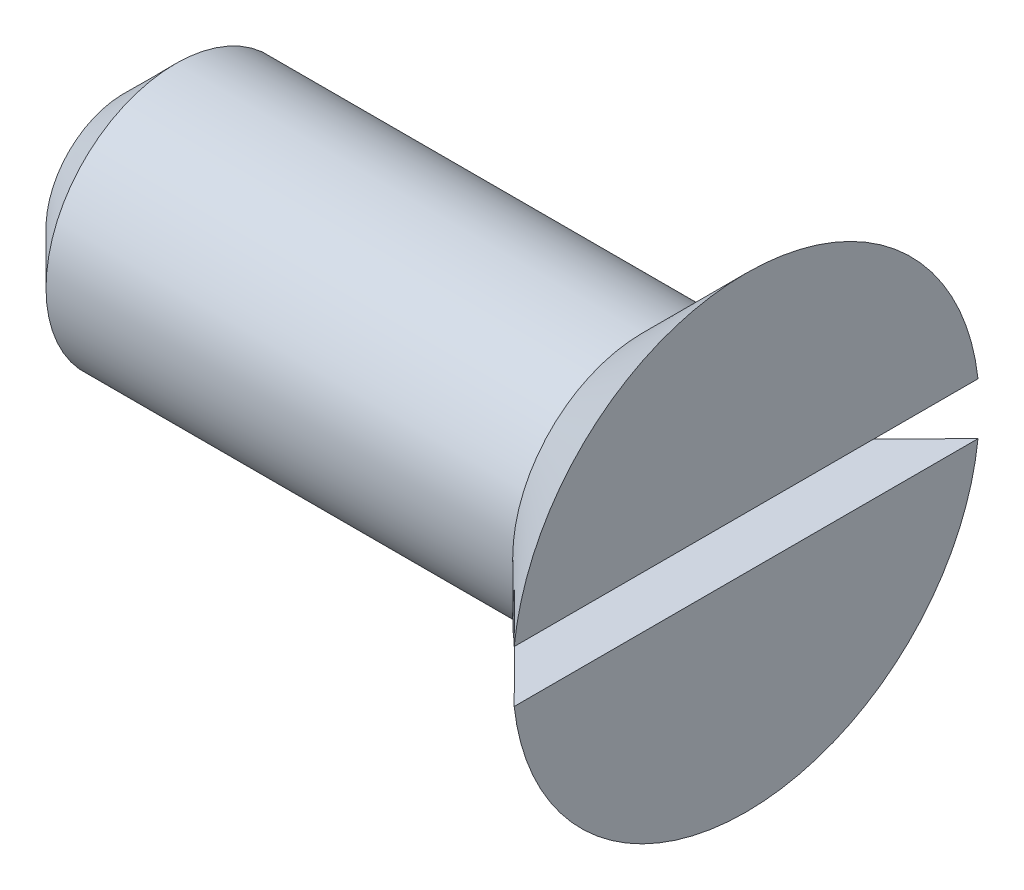
ISO-10303-21;
HEADER;
FILE_DESCRIPTION(('STEP AP214'),'2;1');
FILE_NAME('part.step','',(''),(''),'','','');
FILE_SCHEMA(('AUTOMOTIVE_DESIGN { 1 0 10303 214 1 1 1 1 }'));
ENDSEC;
DATA;
#1=APPLICATION_CONTEXT('core data for automotive mechanical design processes');
#2=APPLICATION_PROTOCOL_DEFINITION('international standard','automotive_design',2000,#1);
#3=PRODUCT_CONTEXT('',#1,'mechanical');
#4=PRODUCT('Part','Part','',(#3));
#5=PRODUCT_RELATED_PRODUCT_CATEGORY('part','',(#4));
#6=PRODUCT_DEFINITION_FORMATION('','',#4);
#7=PRODUCT_DEFINITION_CONTEXT('part definition',#1,'design');
#8=PRODUCT_DEFINITION('design','',#6,#7);
#9=PRODUCT_DEFINITION_SHAPE('','',#8);
#10=(LENGTH_UNIT() NAMED_UNIT(*) SI_UNIT(.MILLI.,.METRE.));
#11=(NAMED_UNIT(*) PLANE_ANGLE_UNIT() SI_UNIT($,.RADIAN.));
#12=(NAMED_UNIT(*) SI_UNIT($,.STERADIAN.) SOLID_ANGLE_UNIT());
#13=UNCERTAINTY_MEASURE_WITH_UNIT(LENGTH_MEASURE(1.E-05),#10,'distance_accuracy_value','');
#14=(GEOMETRIC_REPRESENTATION_CONTEXT(3) GLOBAL_UNCERTAINTY_ASSIGNED_CONTEXT((#13)) GLOBAL_UNIT_ASSIGNED_CONTEXT((#10,
#11,#12)) REPRESENTATION_CONTEXT('',''));
#15=CARTESIAN_POINT('',(0.,0.,0.));
#16=DIRECTION('',(0.,0.,1.));
#17=DIRECTION('',(1.,0.,0.));
#18=AXIS2_PLACEMENT_3D('',#15,#16,#17);
#19=CARTESIAN_POINT('',(12.,0.,-4.50000000000001));
#20=DIRECTION('',(-1.,0.,0.));
#21=DIRECTION('',(0.,0.,1.));
#22=AXIS2_PLACEMENT_3D('',#19,#20,#21);
#23=PLANE('',#22);
#24=CARTESIAN_POINT('',(12.,0.,0.));
#25=DIRECTION('',(-1.,0.,0.));
#26=DIRECTION('',(0.,0.,1.));
#27=AXIS2_PLACEMENT_3D('',#24,#25,#26);
#28=CIRCLE('',#27,4.50000000000001);
#29=CARTESIAN_POINT('',(12.,0.499999999999999,4.47213595499959));
#30=VERTEX_POINT('',#29);
#31=CARTESIAN_POINT('',(12.,0.500000000000001,-4.47213595499959));
#32=VERTEX_POINT('',#31);
#33=EDGE_CURVE('E96',#30,#32,#28,.T.);
#34=ORIENTED_EDGE('',*,*,#33,.F.);
#35=DIRECTION('',(0.,0.,1.));
#36=VECTOR('',#35,1.);
#37=CARTESIAN_POINT('',(12.,0.500000000000001,-4.82876236688435));
#38=LINE('',#37,#36);
#39=EDGE_CURVE('E91',#32,#30,#38,.T.);
#40=ORIENTED_EDGE('',*,*,#39,.F.);
#41=EDGE_LOOP('',(#34,#40));
#42=FACE_BOUND('',#41,.T.);
#43=ADVANCED_FACE('F35',(#42),#23,.F.);
#44=CARTESIAN_POINT('',(0.,0.,-2.5));
#45=DIRECTION('',(1.,0.,0.));
#46=DIRECTION('',(0.,0.,-1.));
#47=AXIS2_PLACEMENT_3D('',#44,#45,#46);
#48=PLANE('',#47);
#49=CARTESIAN_POINT('',(0.,0.,0.));
#50=DIRECTION('',(1.,0.,0.));
#51=DIRECTION('',(0.,0.,-1.));
#52=AXIS2_PLACEMENT_3D('',#49,#50,#51);
#53=CIRCLE('',#52,1.5);
#54=CARTESIAN_POINT('',(0.,0.,-1.5));
#55=VERTEX_POINT('',#54);
#56=EDGE_CURVE('E100',#55,#55,#53,.F.);
#57=ORIENTED_EDGE('',*,*,#56,.T.);
#58=EDGE_LOOP('',(#57));
#59=FACE_BOUND('',#58,.T.);
#60=ADVANCED_FACE('F135',(#59),#48,.F.);
#61=CARTESIAN_POINT('',(12.,-0.499999999999999,-4.47213595499959));
#62=VERTEX_POINT('',#61);
#63=CARTESIAN_POINT('',(12.,-0.500000000000001,4.47213595499959));
#64=VERTEX_POINT('',#63);
#65=EDGE_CURVE('E90',#62,#64,#28,.T.);
#66=ORIENTED_EDGE('',*,*,#65,.F.);
#67=DIRECTION('',(0.,0.,-1.));
#68=VECTOR('',#67,1.);
#69=CARTESIAN_POINT('',(12.,-0.499999999999999,-4.82876236688435));
#70=LINE('',#69,#68);
#71=EDGE_CURVE('E82',#64,#62,#70,.T.);
#72=ORIENTED_EDGE('',*,*,#71,.F.);
#73=EDGE_LOOP('',(#66,#72));
#74=FACE_BOUND('',#73,.T.);
#75=ADVANCED_FACE('F89',(#74),#23,.F.);
#76=CARTESIAN_POINT('',(12.,0.,0.));
#77=DIRECTION('',(1.,0.,0.));
#78=DIRECTION('',(0.,0.,-1.));
#79=AXIS2_PLACEMENT_3D('',#76,#77,#78);
#80=CONICAL_SURFACE('',#79,4.50000000000001,0.78539816339745);
#81=CARTESIAN_POINT('',(11.,0.,0.));
#82=DIRECTION('',(1.,0.,0.));
#83=DIRECTION('',(0.,0.,-1.));
#84=AXIS2_PLACEMENT_3D('',#81,#82,#83);
#85=CIRCLE('',#84,3.5);
#86=CARTESIAN_POINT('',(11.,0.5,3.46410161513776));
#87=VERTEX_POINT('',#86);
#88=CARTESIAN_POINT('',(11.,-0.5,3.46410161513776));
#89=VERTEX_POINT('',#88);
#90=EDGE_CURVE('E61',#87,#89,#85,.T.);
#91=ORIENTED_EDGE('',*,*,#90,.F.);
#92=CARTESIAN_POINT('',(17.4334310828825,0.500000000000001,-9.92083933336167));
#93=CARTESIAN_POINT('',(17.0946228366973,0.500000000000001,-9.58159761232873));
#94=CARTESIAN_POINT('',(16.7558333911426,0.500000000000001,-9.2423371047864));
#95=CARTESIAN_POINT('',(16.0783139348755,0.500000000000001,-8.56375204602205));
#96=CARTESIAN_POINT('',(15.739583924592,0.500000000000001,-8.22442749437174));
#97=CARTESIAN_POINT('',(15.0621562101748,0.500000000000001,-7.54563881131531));
#98=CARTESIAN_POINT('',(14.7234585196653,0.500000000000001,-7.20617466631178));
#99=CARTESIAN_POINT('',(14.0461951542344,0.500000000000001,-6.52711926847519));
#100=CARTESIAN_POINT('',(13.7076294784351,0.500000000000001,-6.18752801651797));
#101=CARTESIAN_POINT('',(13.0230688559564,0.500000000000001,-5.50046940667581));
#102=CARTESIAN_POINT('',(12.6770786993011,0.500000000000001,-5.15299727609709));
#103=CARTESIAN_POINT('',(11.9854716695163,0.500000000000001,-4.45766761429764));
#104=CARTESIAN_POINT('',(11.6398548039755,0.500000000000001,-4.10981007552263));
#105=CARTESIAN_POINT('',(11.1220495656038,0.5,-3.58744392362607));
#106=CARTESIAN_POINT('',(10.9495599143595,0.5,-3.41323410184891));
#107=CARTESIAN_POINT('',(10.6049016321717,0.5,-3.06449437077969));
#108=CARTESIAN_POINT('',(10.4327330038442,0.5,-2.88996445890203));
#109=CARTESIAN_POINT('',(10.0889298219536,0.5,-2.54039099536454));
#110=CARTESIAN_POINT('',(9.91729524885471,0.5,-2.36534746295891));
#111=CARTESIAN_POINT('',(9.66060434587554,0.5,-2.10204221393845));
#112=CARTESIAN_POINT('',(9.57516809923433,0.5,-2.0141510552663));
#113=CARTESIAN_POINT('',(9.40467044483115,0.5,-1.83800611141631));
#114=CARTESIAN_POINT('',(9.31960903527122,0.5,-1.74975232798178));
#115=CARTESIAN_POINT('',(9.18895844071343,0.5,-1.61330986537998));
#116=CARTESIAN_POINT('',(9.14316496752917,0.5,-1.56531689311638));
#117=CARTESIAN_POINT('',(9.05179993977996,0.5,-1.46911892921277));
#118=CARTESIAN_POINT('',(9.00622838798683,0.5,-1.42091393493881));
#119=CARTESIAN_POINT('',(8.91548272609732,0.5,-1.32433574945206));
#120=CARTESIAN_POINT('',(8.87030795026291,0.5,-1.2759631851432));
#121=CARTESIAN_POINT('',(8.7803664438275,0.5,-1.17884327238506));
#122=CARTESIAN_POINT('',(8.73559970075942,0.5,-1.13009593547108));
#123=CARTESIAN_POINT('',(8.63156798542612,0.5,-1.01549018412831));
#124=CARTESIAN_POINT('',(8.57252649589827,0.5,-0.949426917329317));
#125=CARTESIAN_POINT('',(8.48517998290922,0.5,-0.849027252818854));
#126=CARTESIAN_POINT('',(8.45620834486431,0.5,-0.815271939590713));
#127=CARTESIAN_POINT('',(8.39889657787292,0.5,-0.747230628197203));
#128=CARTESIAN_POINT('',(8.37055641002426,0.5,-0.712944662944775));
#129=CARTESIAN_POINT('',(8.3145329446323,0.5,-0.643346670958045));
#130=CARTESIAN_POINT('',(8.28685743704767,0.5,-0.608028338857883));
#131=CARTESIAN_POINT('',(8.23288658906743,0.5,-0.536358792809923));
#132=CARTESIAN_POINT('',(8.20659077183423,0.5,-0.500007942497519));
#133=CARTESIAN_POINT('',(8.15629156070253,0.5,-0.425977065401623));
#134=CARTESIAN_POINT('',(8.13227821986791,0.5,-0.388303888131556));
#135=CARTESIAN_POINT('',(8.08791744878541,0.5,-0.310893832366642));
#136=CARTESIAN_POINT('',(8.06756045180677,0.5,-0.271162700482673));
#137=CARTESIAN_POINT('',(8.03752958522045,0.5,-0.199280580631231));
#138=CARTESIAN_POINT('',(8.02645653543281,0.5,-0.167736256205768));
#139=CARTESIAN_POINT('',(8.0096325080779,0.5,-0.103336815944202));
#140=CARTESIAN_POINT('',(8.00385536010018,0.5,-0.0704889918034758));
#141=CARTESIAN_POINT('',(7.99890901284611,0.5,-0.00391759075675042));
#142=CARTESIAN_POINT('',(7.99980881923364,0.5,0.0298115312901689));
#143=CARTESIAN_POINT('',(8.00813776796033,0.5,0.0965071541620183));
#144=CARTESIAN_POINT('',(8.01558887477223,0.5,0.129470706321317));
#145=CARTESIAN_POINT('',(8.03280310431991,0.5,0.185466604172844));
#146=CARTESIAN_POINT('',(8.04146820312044,0.5,0.208860616960488));
#147=CARTESIAN_POINT('',(8.06080064801209,0.5,0.25481666318091));
#148=CARTESIAN_POINT('',(8.07146948011857,0.5,0.277378064174972));
#149=CARTESIAN_POINT('',(8.09431898535455,0.5,0.321840394643773));
#150=CARTESIAN_POINT('',(8.10650643866038,0.5,0.343737776914007));
#151=CARTESIAN_POINT('',(8.13196003283893,0.5,0.386877858467677));
#152=CARTESIAN_POINT('',(8.14522573137349,0.5,0.408120821336482));
#153=CARTESIAN_POINT('',(8.19135616707461,0.5,0.478982606501848));
#154=CARTESIAN_POINT('',(8.22605662646362,0.5,0.527397940682404));
#155=CARTESIAN_POINT('',(8.29781340694133,0.5,0.622462852285317));
#156=CARTESIAN_POINT('',(8.33487192774727,0.5,0.669110714249816));
#157=CARTESIAN_POINT('',(8.41048560367645,0.5,0.761369243961061));
#158=CARTESIAN_POINT('',(8.44904426520717,0.5,0.806977030623934));
#159=CARTESIAN_POINT('',(8.52703681580963,0.5,0.897398644490791));
#160=CARTESIAN_POINT('',(8.56647033422441,0.5,0.942212793997126));
#161=CARTESIAN_POINT('',(8.64602665873742,0.5,1.03139885551567));
#162=CARTESIAN_POINT('',(8.68615077588472,0.5,1.0757695956385));
#163=CARTESIAN_POINT('',(8.76683137244624,0.5,1.16412357585895));
#164=CARTESIAN_POINT('',(8.80738789578226,0.5,1.20810677574714));
#165=CARTESIAN_POINT('',(8.92939021280778,0.5,1.33948593317254));
#166=CARTESIAN_POINT('',(9.01129691946354,0.5,1.4264534203661));
#167=CARTESIAN_POINT('',(9.1750561674327,0.5,1.5989137134355));
#168=CARTESIAN_POINT('',(9.256902208501,0.5,1.68441271958706));
#169=CARTESIAN_POINT('',(9.42104405611673,0.5,1.85497829095495));
#170=CARTESIAN_POINT('',(9.50333986440311,0.5,1.94004485449686));
#171=CARTESIAN_POINT('',(9.75067700605355,0.5,2.19481879501892));
#172=CARTESIAN_POINT('',(9.91616244229036,0.5,2.36409455788242));
#173=CARTESIAN_POINT('',(10.2478424695678,0.5,2.70216112923891));
#174=CARTESIAN_POINT('',(10.4140374466652,0.5,2.87095155805323));
#175=CARTESIAN_POINT('',(10.746786507318,0.5,3.20817270389182));
#176=CARTESIAN_POINT('',(10.9133405850955,0.5,3.37660342661822));
#177=CARTESIAN_POINT('',(11.2461450940213,0.5,3.71270085679017));
#178=CARTESIAN_POINT('',(11.4123947962971,0.5,3.88036828639741));
#179=CARTESIAN_POINT('',(11.7450495611608,0.5,4.21555034245577));
#180=CARTESIAN_POINT('',(11.9114546244026,0.499999999999999,4.38306496825788));
#181=CARTESIAN_POINT('',(12.4107648936874,0.499999999999999,4.88538300082721));
#182=CARTESIAN_POINT('',(12.7438307481319,0.499999999999999,5.2200266956286));
#183=CARTESIAN_POINT('',(13.4391444176961,0.499999999999999,5.91814806333948));
#184=CARTESIAN_POINT('',(13.8014133442453,0.499999999999999,6.28160470105013));
#185=CARTESIAN_POINT('',(14.5261395420025,0.499999999999999,7.0083789684796));
#186=CARTESIAN_POINT('',(14.8885968242542,0.499999999999999,7.37169658718518));
#187=CARTESIAN_POINT('',(15.6147555520495,0.499999999999999,8.09937108507478));
#188=CARTESIAN_POINT('',(15.9784573244745,0.499999999999999,8.46372763802071));
#189=CARTESIAN_POINT('',(16.7059094181817,0.499999999999999,9.19234290705773));
#190=CARTESIAN_POINT('',(17.0696597344943,0.499999999999999,9.55660162811023));
#191=CARTESIAN_POINT('',(17.4334310828825,0.499999999999999,9.92083933336167));
#192=B_SPLINE_CURVE_WITH_KNOTS('',3,(#92,#93,#94,#95,#96,#97,#98,#99,#100,#101,#102,#103,#104,
#105,#106,#107,#108,#109,#110,#111,#112,#113,#114,#115,#116,#117,#118,#119,#120,#121,#122,#123,
#124,#125,#126,#127,#128,#129,#130,#131,#132,#133,#134,#135,#136,#137,#138,#139,#140,#141,#142,
#143,#144,#145,#146,#147,#148,#149,#150,#151,#152,#153,#154,#155,#156,#157,#158,#159,#160,#161,
#162,#163,#164,#165,#166,#167,#168,#169,#170,#171,#172,#173,#174,#175,#176,#177,#178,#179,#180,
#181,#182,#183,#184,#185,#186,#187,#188,#189,#190,#191),.UNSPECIFIED.,.F.,.F.,(4,2,2,2,2,2,2,2,
2,2,2,2,2,2,2,2,2,2,2,2,2,2,2,2,2,2,2,2,2,2,2,2,2,2,2,2,2,2,2,2,2,2,2,2,2,2,2,2,2,4),(0.,
1.43836149369586,2.87673297314477,4.31533237234486,5.75392203488505,7.22498096900736,
8.69606926591944,9.43153865323627,10.1670140078309,10.9024621350021,11.2701813429493,
11.6378987851441,11.8369040385591,12.0359117712346,12.234469454211,12.4330210499611,
12.6988031931159,12.8322483695487,12.9656853021402,13.1002750154335,13.2348179022846,
13.368744633288,13.5023156749386,13.6022937476694,13.7017750593223,13.8022859216984,
13.9031350562218,13.9778743300512,14.0526692527234,14.1278109554225,14.2029219861666,
14.3814550436047,14.560157159055,14.7393055443467,14.9183794257298,15.0978422373141,
15.2773234549253,15.6357121558071,15.9907874462889,16.3458641105813,17.0560417926077,
17.76667396055,18.4772947785456,19.1856462514834,19.8940007191567,21.3104302706823,
22.849928673822,24.3895307818801,25.9339763327718,27.4783170755757),.UNSPECIFIED.);
#193=EDGE_CURVE('E11',#87,#30,#192,.T.);
#194=ORIENTED_EDGE('',*,*,#193,.T.);
#195=ORIENTED_EDGE('',*,*,#33,.T.);
#196=CARTESIAN_POINT('',(11.,0.5,-3.46410161513776));
#197=VERTEX_POINT('',#196);
#198=EDGE_CURVE('E39',#32,#197,#192,.T.);
#199=ORIENTED_EDGE('',*,*,#198,.T.);
#200=CARTESIAN_POINT('',(11.,-0.5,-3.46410161513776));
#201=VERTEX_POINT('',#200);
#202=EDGE_CURVE('E111',#201,#197,#85,.T.);
#203=ORIENTED_EDGE('',*,*,#202,.F.);
#204=CARTESIAN_POINT('',(17.4334310828825,-0.500000000000001,9.92083933336167));
#205=CARTESIAN_POINT('',(17.0946228366973,-0.500000000000001,9.58159761232873));
#206=CARTESIAN_POINT('',(16.7558333911426,-0.500000000000001,9.2423371047864));
#207=CARTESIAN_POINT('',(16.0783139348755,-0.500000000000001,8.56375204602205));
#208=CARTESIAN_POINT('',(15.739583924592,-0.500000000000001,8.22442749437174));
#209=CARTESIAN_POINT('',(15.0621562101748,-0.500000000000001,7.54563881131531));
#210=CARTESIAN_POINT('',(14.7234585196653,-0.500000000000001,7.20617466631178));
#211=CARTESIAN_POINT('',(14.0461951542344,-0.500000000000001,6.52711926847519));
#212=CARTESIAN_POINT('',(13.7076294784351,-0.500000000000001,6.18752801651797));
#213=CARTESIAN_POINT('',(13.0230688559564,-0.500000000000001,5.50046940667581));
#214=CARTESIAN_POINT('',(12.6770786993011,-0.500000000000001,5.15299727609709));
#215=CARTESIAN_POINT('',(11.9854716695163,-0.500000000000001,4.45766761429764));
#216=CARTESIAN_POINT('',(11.6398548039755,-0.500000000000001,4.10981007552263));
#217=CARTESIAN_POINT('',(11.1220495656038,-0.5,3.58744392362607));
#218=CARTESIAN_POINT('',(10.9495599143595,-0.5,3.41323410184891));
#219=CARTESIAN_POINT('',(10.6049016321717,-0.5,3.06449437077969));
#220=CARTESIAN_POINT('',(10.4327330038442,-0.5,2.88996445890203));
#221=CARTESIAN_POINT('',(10.0889298219536,-0.5,2.54039099536454));
#222=CARTESIAN_POINT('',(9.91729524885471,-0.5,2.36534746295891));
#223=CARTESIAN_POINT('',(9.66060434587554,-0.5,2.10204221393845));
#224=CARTESIAN_POINT('',(9.57516809923433,-0.5,2.0141510552663));
#225=CARTESIAN_POINT('',(9.40467044483115,-0.5,1.83800611141631));
#226=CARTESIAN_POINT('',(9.31960903527122,-0.5,1.74975232798178));
#227=CARTESIAN_POINT('',(9.18895844071343,-0.5,1.61330986537998));
#228=CARTESIAN_POINT('',(9.14316496752917,-0.5,1.56531689311638));
#229=CARTESIAN_POINT('',(9.05179993977996,-0.5,1.46911892921277));
#230=CARTESIAN_POINT('',(9.00622838798683,-0.5,1.42091393493881));
#231=CARTESIAN_POINT('',(8.91548272609732,-0.5,1.32433574945206));
#232=CARTESIAN_POINT('',(8.87030795026291,-0.5,1.2759631851432));
#233=CARTESIAN_POINT('',(8.7803664438275,-0.5,1.17884327238506));
#234=CARTESIAN_POINT('',(8.73559970075942,-0.5,1.13009593547108));
#235=CARTESIAN_POINT('',(8.63156798542612,-0.5,1.01549018412831));
#236=CARTESIAN_POINT('',(8.57252649589827,-0.5,0.949426917329317));
#237=CARTESIAN_POINT('',(8.48517998290922,-0.5,0.849027252818854));
#238=CARTESIAN_POINT('',(8.45620834486431,-0.5,0.815271939590713));
#239=CARTESIAN_POINT('',(8.39889657787292,-0.5,0.747230628197203));
#240=CARTESIAN_POINT('',(8.37055641002426,-0.5,0.712944662944775));
#241=CARTESIAN_POINT('',(8.3145329446323,-0.5,0.643346670958045));
#242=CARTESIAN_POINT('',(8.28685743704767,-0.5,0.608028338857883));
#243=CARTESIAN_POINT('',(8.23288658906743,-0.5,0.536358792809923));
#244=CARTESIAN_POINT('',(8.20659077183423,-0.5,0.500007942497519));
#245=CARTESIAN_POINT('',(8.15629156070253,-0.5,0.425977065401623));
#246=CARTESIAN_POINT('',(8.13227821986791,-0.5,0.388303888131556));
#247=CARTESIAN_POINT('',(8.08791744878541,-0.5,0.310893832366642));
#248=CARTESIAN_POINT('',(8.06756045180677,-0.5,0.271162700482673));
#249=CARTESIAN_POINT('',(8.03752958522045,-0.5,0.199280580631231));
#250=CARTESIAN_POINT('',(8.02645653543281,-0.5,0.167736256205768));
#251=CARTESIAN_POINT('',(8.0096325080779,-0.5,0.103336815944202));
#252=CARTESIAN_POINT('',(8.00385536010018,-0.5,0.0704889918034758));
#253=CARTESIAN_POINT('',(7.99890901284611,-0.5,0.00391759075675042));
#254=CARTESIAN_POINT('',(7.99980881923364,-0.5,-0.0298115312901689));
#255=CARTESIAN_POINT('',(8.00813776796033,-0.5,-0.0965071541620183));
#256=CARTESIAN_POINT('',(8.01558887477223,-0.5,-0.129470706321317));
#257=CARTESIAN_POINT('',(8.03280310431991,-0.5,-0.185466604172844));
#258=CARTESIAN_POINT('',(8.04146820312044,-0.5,-0.208860616960488));
#259=CARTESIAN_POINT('',(8.06080064801209,-0.5,-0.25481666318091));
#260=CARTESIAN_POINT('',(8.07146948011857,-0.5,-0.277378064174972));
#261=CARTESIAN_POINT('',(8.09431898535455,-0.5,-0.321840394643773));
#262=CARTESIAN_POINT('',(8.10650643866038,-0.5,-0.343737776914007));
#263=CARTESIAN_POINT('',(8.13196003283893,-0.5,-0.386877858467677));
#264=CARTESIAN_POINT('',(8.14522573137349,-0.5,-0.408120821336482));
#265=CARTESIAN_POINT('',(8.19135616707461,-0.5,-0.478982606501848));
#266=CARTESIAN_POINT('',(8.22605662646362,-0.5,-0.527397940682404));
#267=CARTESIAN_POINT('',(8.29781340694133,-0.5,-0.622462852285317));
#268=CARTESIAN_POINT('',(8.33487192774727,-0.5,-0.669110714249816));
#269=CARTESIAN_POINT('',(8.41048560367645,-0.5,-0.761369243961061));
#270=CARTESIAN_POINT('',(8.44904426520717,-0.5,-0.806977030623934));
#271=CARTESIAN_POINT('',(8.52703681580963,-0.5,-0.897398644490791));
#272=CARTESIAN_POINT('',(8.56647033422441,-0.5,-0.942212793997126));
#273=CARTESIAN_POINT('',(8.64602665873742,-0.5,-1.03139885551567));
#274=CARTESIAN_POINT('',(8.68615077588472,-0.5,-1.0757695956385));
#275=CARTESIAN_POINT('',(8.76683137244624,-0.5,-1.16412357585895));
#276=CARTESIAN_POINT('',(8.80738789578226,-0.5,-1.20810677574714));
#277=CARTESIAN_POINT('',(8.92939021280778,-0.5,-1.33948593317254));
#278=CARTESIAN_POINT('',(9.01129691946354,-0.5,-1.4264534203661));
#279=CARTESIAN_POINT('',(9.1750561674327,-0.5,-1.5989137134355));
#280=CARTESIAN_POINT('',(9.256902208501,-0.5,-1.68441271958706));
#281=CARTESIAN_POINT('',(9.42104405611673,-0.5,-1.85497829095495));
#282=CARTESIAN_POINT('',(9.50333986440311,-0.5,-1.94004485449686));
#283=CARTESIAN_POINT('',(9.75067700605355,-0.5,-2.19481879501892));
#284=CARTESIAN_POINT('',(9.91616244229036,-0.5,-2.36409455788242));
#285=CARTESIAN_POINT('',(10.2478424695678,-0.5,-2.70216112923891));
#286=CARTESIAN_POINT('',(10.4140374466652,-0.5,-2.87095155805323));
#287=CARTESIAN_POINT('',(10.746786507318,-0.5,-3.20817270389182));
#288=CARTESIAN_POINT('',(10.9133405850955,-0.5,-3.37660342661822));
#289=CARTESIAN_POINT('',(11.2461450940213,-0.5,-3.71270085679017));
#290=CARTESIAN_POINT('',(11.4123947962971,-0.5,-3.88036828639741));
#291=CARTESIAN_POINT('',(11.7450495611608,-0.5,-4.21555034245577));
#292=CARTESIAN_POINT('',(11.9114546244026,-0.499999999999999,-4.38306496825788));
#293=CARTESIAN_POINT('',(12.4107648936874,-0.499999999999999,-4.88538300082721));
#294=CARTESIAN_POINT('',(12.7438307481319,-0.499999999999999,-5.2200266956286));
#295=CARTESIAN_POINT('',(13.4391444176961,-0.499999999999999,-5.91814806333948));
#296=CARTESIAN_POINT('',(13.8014133442453,-0.499999999999999,-6.28160470105013));
#297=CARTESIAN_POINT('',(14.5261395420025,-0.499999999999999,-7.0083789684796));
#298=CARTESIAN_POINT('',(14.8885968242542,-0.499999999999999,-7.37169658718518));
#299=CARTESIAN_POINT('',(15.6147555520495,-0.499999999999999,-8.09937108507478));
#300=CARTESIAN_POINT('',(15.9784573244745,-0.499999999999999,-8.46372763802071));
#301=CARTESIAN_POINT('',(16.7059094181817,-0.499999999999999,-9.19234290705773));
#302=CARTESIAN_POINT('',(17.0696597344943,-0.499999999999999,-9.55660162811023));
#303=CARTESIAN_POINT('',(17.4334310828825,-0.499999999999999,-9.92083933336167));
#304=B_SPLINE_CURVE_WITH_KNOTS('',3,(#204,#205,#206,#207,#208,#209,#210,#211,#212,#213,#214,
#215,#216,#217,#218,#219,#220,#221,#222,#223,#224,#225,#226,#227,#228,#229,#230,#231,#232,#233,
#234,#235,#236,#237,#238,#239,#240,#241,#242,#243,#244,#245,#246,#247,#248,#249,#250,#251,#252,
#253,#254,#255,#256,#257,#258,#259,#260,#261,#262,#263,#264,#265,#266,#267,#268,#269,#270,#271,
#272,#273,#274,#275,#276,#277,#278,#279,#280,#281,#282,#283,#284,#285,#286,#287,#288,#289,#290,
#291,#292,#293,#294,#295,#296,#297,#298,#299,#300,#301,#302,#303),.UNSPECIFIED.,.F.,.F.,(4,2,2,
2,2,2,2,2,2,2,2,2,2,2,2,2,2,2,2,2,2,2,2,2,2,2,2,2,2,2,2,2,2,2,2,2,2,2,2,2,2,2,2,2,2,2,2,2,2,4),
(0.,1.43836149369586,2.87673297314477,4.31533237234486,5.75392203488505,7.22498096900736,
8.69606926591944,9.43153865323627,10.1670140078309,10.9024621350021,11.2701813429493,
11.6378987851441,11.8369040385591,12.0359117712346,12.234469454211,12.4330210499611,
12.6988031931159,12.8322483695487,12.9656853021402,13.1002750154335,13.2348179022846,
13.368744633288,13.5023156749386,13.6022937476694,13.7017750593223,13.8022859216984,
13.9031350562218,13.9778743300512,14.0526692527234,14.1278109554225,14.2029219861666,
14.3814550436047,14.560157159055,14.7393055443467,14.9183794257298,15.0978422373141,
15.2773234549253,15.6357121558071,15.9907874462889,16.3458641105813,17.0560417926077,
17.76667396055,18.4772947785456,19.1856462514834,19.8940007191567,21.3104302706823,
22.849928673822,24.3895307818801,25.9339763327718,27.4783170755757),.UNSPECIFIED.);
#305=EDGE_CURVE('E86',#201,#62,#304,.T.);
#306=ORIENTED_EDGE('',*,*,#305,.T.);
#307=ORIENTED_EDGE('',*,*,#65,.T.);
#308=EDGE_CURVE('E49',#64,#89,#304,.T.);
#309=ORIENTED_EDGE('',*,*,#308,.T.);
#310=EDGE_LOOP('',(#91,#194,#195,#199,#203,#306,#307,#309));
#311=FACE_BOUND('',#310,.T.);
#312=CARTESIAN_POINT('',(10.,0.,0.));
#313=DIRECTION('',(-1.,0.,0.));
#314=DIRECTION('',(0.,0.,1.));
#315=AXIS2_PLACEMENT_3D('',#312,#313,#314);
#316=CIRCLE('',#315,2.5);
#317=CARTESIAN_POINT('',(10.,0.,2.5));
#318=VERTEX_POINT('',#317);
#319=EDGE_CURVE('E97',#318,#318,#316,.T.);
#320=ORIENTED_EDGE('',*,*,#319,.F.);
#321=EDGE_LOOP('',(#320));
#322=FACE_BOUND('',#321,.T.);
#323=ADVANCED_FACE('F93',(#311,#322),#80,.T.);
#324=CARTESIAN_POINT('',(0.,0.,0.));
#325=DIRECTION('',(-1.,0.,0.));
#326=DIRECTION('',(0.,0.,1.));
#327=AXIS2_PLACEMENT_3D('',#324,#325,#326);
#328=CYLINDRICAL_SURFACE('',#327,2.5);
#329=CARTESIAN_POINT('',(1.,0.,0.));
#330=DIRECTION('',(1.,0.,0.));
#331=DIRECTION('',(0.,0.,-1.));
#332=AXIS2_PLACEMENT_3D('',#329,#330,#331);
#333=CIRCLE('',#332,2.5);
#334=CARTESIAN_POINT('',(1.,0.,-2.5));
#335=VERTEX_POINT('',#334);
#336=EDGE_CURVE('E108',#335,#335,#333,.T.);
#337=ORIENTED_EDGE('',*,*,#336,.T.);
#338=EDGE_LOOP('',(#337));
#339=FACE_BOUND('',#338,.T.);
#340=ORIENTED_EDGE('',*,*,#319,.T.);
#341=EDGE_LOOP('',(#340));
#342=FACE_BOUND('',#341,.T.);
#343=ADVANCED_FACE('F125',(#339,#342),#328,.T.);
#344=CARTESIAN_POINT('',(0.,0.,0.));
#345=DIRECTION('',(1.,0.,0.));
#346=DIRECTION('',(0.,0.,-1.));
#347=AXIS2_PLACEMENT_3D('',#344,#345,#346);
#348=CONICAL_SURFACE('',#347,1.5,0.785398163397447);
#349=ORIENTED_EDGE('',*,*,#336,.F.);
#350=EDGE_LOOP('',(#349));
#351=FACE_BOUND('',#350,.T.);
#352=ORIENTED_EDGE('',*,*,#56,.F.);
#353=EDGE_LOOP('',(#352));
#354=FACE_BOUND('',#353,.T.);
#355=ADVANCED_FACE('F37',(#351,#354),#348,.T.);
#356=CARTESIAN_POINT('',(11.,0.500000000000001,-4.82876236688435));
#357=DIRECTION('',(0.,1.,0.));
#358=DIRECTION('',(0.,0.,1.));
#359=AXIS2_PLACEMENT_3D('',#356,#357,#358);
#360=PLANE('',#359);
#361=ORIENTED_EDGE('',*,*,#39,.T.);
#362=ORIENTED_EDGE('',*,*,#193,.F.);
#363=DIRECTION('',(0.,0.,1.));
#364=VECTOR('',#363,1.);
#365=CARTESIAN_POINT('',(11.,0.500000000000001,-4.82876236688435));
#366=LINE('',#365,#364);
#367=EDGE_CURVE('E102',#197,#87,#366,.T.);
#368=ORIENTED_EDGE('',*,*,#367,.F.);
#369=ORIENTED_EDGE('',*,*,#198,.F.);
#370=EDGE_LOOP('',(#361,#362,#368,#369));
#371=FACE_BOUND('',#370,.T.);
#372=ADVANCED_FACE('F122',(#371),#360,.F.);
#373=CARTESIAN_POINT('',(11.,-0.499999999999999,-4.82876236688435));
#374=DIRECTION('',(0.,-1.,0.));
#375=DIRECTION('',(0.,0.,-1.));
#376=AXIS2_PLACEMENT_3D('',#373,#374,#375);
#377=PLANE('',#376);
#378=ORIENTED_EDGE('',*,*,#71,.T.);
#379=ORIENTED_EDGE('',*,*,#305,.F.);
#380=DIRECTION('',(0.,0.,-1.));
#381=VECTOR('',#380,1.);
#382=CARTESIAN_POINT('',(11.,-0.499999999999999,-4.82876236688435));
#383=LINE('',#382,#381);
#384=EDGE_CURVE('E56',#89,#201,#383,.T.);
#385=ORIENTED_EDGE('',*,*,#384,.F.);
#386=ORIENTED_EDGE('',*,*,#308,.F.);
#387=EDGE_LOOP('',(#378,#379,#385,#386));
#388=FACE_BOUND('',#387,.T.);
#389=ADVANCED_FACE('F81',(#388),#377,.F.);
#390=CARTESIAN_POINT('',(11.,0.,0.));
#391=DIRECTION('',(1.,0.,0.));
#392=DIRECTION('',(0.,0.,-1.));
#393=AXIS2_PLACEMENT_3D('',#390,#391,#392);
#394=PLANE('',#393);
#395=ORIENTED_EDGE('',*,*,#90,.T.);
#396=ORIENTED_EDGE('',*,*,#384,.T.);
#397=ORIENTED_EDGE('',*,*,#202,.T.);
#398=ORIENTED_EDGE('',*,*,#367,.T.);
#399=EDGE_LOOP('',(#395,#396,#397,#398));
#400=FACE_BOUND('',#399,.T.);
#401=ADVANCED_FACE('F121',(#400),#394,.T.);
#402=CLOSED_SHELL('',(#43,#60,#75,#323,#343,#355,#372,#389,#401));
#403=MANIFOLD_SOLID_BREP('B2',#402);
#404=ADVANCED_BREP_SHAPE_REPRESENTATION('',(#18,#403),#14);
#405=SHAPE_DEFINITION_REPRESENTATION(#9,#404);
ENDSEC;
END-ISO-10303-21;
